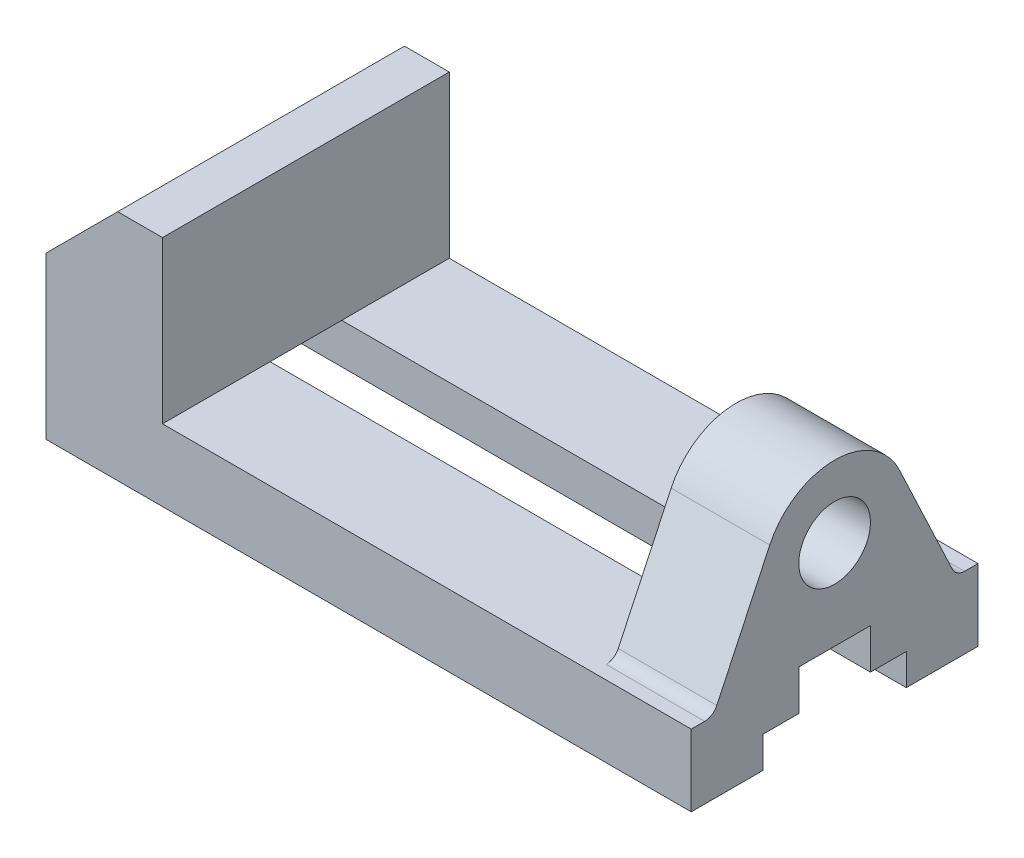
ISO-10303-21;
HEADER;
FILE_DESCRIPTION(('STEP AP214'),'2;1');
FILE_NAME('part.step','',(''),(''),'','','');
FILE_SCHEMA(('AUTOMOTIVE_DESIGN { 1 0 10303 214 1 1 1 1 }'));
ENDSEC;
DATA;
#1=APPLICATION_CONTEXT('core data for automotive mechanical design processes');
#2=APPLICATION_PROTOCOL_DEFINITION('international standard','automotive_design',2000,#1);
#3=PRODUCT_CONTEXT('',#1,'mechanical');
#4=PRODUCT('Part','Part','',(#3));
#5=PRODUCT_RELATED_PRODUCT_CATEGORY('part','',(#4));
#6=PRODUCT_DEFINITION_FORMATION('','',#4);
#7=PRODUCT_DEFINITION_CONTEXT('part definition',#1,'design');
#8=PRODUCT_DEFINITION('design','',#6,#7);
#9=PRODUCT_DEFINITION_SHAPE('','',#8);
#10=(LENGTH_UNIT() NAMED_UNIT(*) SI_UNIT(.MILLI.,.METRE.));
#11=(NAMED_UNIT(*) PLANE_ANGLE_UNIT() SI_UNIT($,.RADIAN.));
#12=(NAMED_UNIT(*) SI_UNIT($,.STERADIAN.) SOLID_ANGLE_UNIT());
#13=UNCERTAINTY_MEASURE_WITH_UNIT(LENGTH_MEASURE(1.E-05),#10,'distance_accuracy_value','');
#14=(GEOMETRIC_REPRESENTATION_CONTEXT(3) GLOBAL_UNCERTAINTY_ASSIGNED_CONTEXT((#13)) GLOBAL_UNIT_ASSIGNED_CONTEXT((#10,
#11,#12)) REPRESENTATION_CONTEXT('',''));
#15=CARTESIAN_POINT('',(0.,0.,0.));
#16=DIRECTION('',(0.,0.,1.));
#17=DIRECTION('',(1.,0.,0.));
#18=AXIS2_PLACEMENT_3D('',#15,#16,#17);
#19=CARTESIAN_POINT('',(-46.,8.,32.));
#20=DIRECTION('',(0.,-1.,0.));
#21=DIRECTION('',(0.,0.,-1.));
#22=AXIS2_PLACEMENT_3D('',#19,#20,#21);
#23=PLANE('',#22);
#24=DIRECTION('',(0.,0.,-1.));
#25=VECTOR('',#24,1.);
#26=CARTESIAN_POINT('',(72.,8.,32.));
#27=LINE('',#26,#25);
#28=CARTESIAN_POINT('',(72.,8.,32.));
#29=VERTEX_POINT('',#28);
#30=CARTESIAN_POINT('',(72.,8.,29.));
#31=VERTEX_POINT('',#30);
#32=EDGE_CURVE('E11',#29,#31,#27,.T.);
#33=ORIENTED_EDGE('',*,*,#32,.T.);
#34=DIRECTION('',(1.,0.,0.));
#35=VECTOR('',#34,1.);
#36=CARTESIAN_POINT('',(50.,8.,29.));
#37=LINE('',#36,#35);
#38=CARTESIAN_POINT('',(50.,8.,29.));
#39=VERTEX_POINT('',#38);
#40=EDGE_CURVE('E248',#39,#31,#37,.T.);
#41=ORIENTED_EDGE('',*,*,#40,.F.);
#42=DIRECTION('',(0.,0.,-1.));
#43=VECTOR('',#42,1.);
#44=CARTESIAN_POINT('',(50.,8.,0.));
#45=LINE('',#44,#43);
#46=CARTESIAN_POINT('',(50.,8.,8.));
#47=VERTEX_POINT('',#46);
#48=EDGE_CURVE('E223',#39,#47,#45,.T.);
#49=ORIENTED_EDGE('',*,*,#48,.T.);
#50=DIRECTION('',(1.,0.,0.));
#51=VECTOR('',#50,1.);
#52=CARTESIAN_POINT('',(-72.001,8.,8.));
#53=LINE('',#52,#51);
#54=CARTESIAN_POINT('',(-46.,8.,8.));
#55=VERTEX_POINT('',#54);
#56=EDGE_CURVE('E301',#55,#47,#53,.T.);
#57=ORIENTED_EDGE('',*,*,#56,.F.);
#58=DIRECTION('',(0.,0.,-1.));
#59=VECTOR('',#58,1.);
#60=CARTESIAN_POINT('',(-46.,8.,32.));
#61=LINE('',#60,#59);
#62=CARTESIAN_POINT('',(-46.,8.,32.));
#63=VERTEX_POINT('',#62);
#64=EDGE_CURVE('E367',#63,#55,#61,.T.);
#65=ORIENTED_EDGE('',*,*,#64,.F.);
#66=DIRECTION('',(-1.,0.,0.));
#67=VECTOR('',#66,1.);
#68=CARTESIAN_POINT('',(-46.,8.,32.));
#69=LINE('',#68,#67);
#70=EDGE_CURVE('E320',#29,#63,#69,.T.);
#71=ORIENTED_EDGE('',*,*,#70,.F.);
#72=EDGE_LOOP('',(#33,#41,#49,#57,#65,#71));
#73=FACE_BOUND('',#72,.T.);
#74=ADVANCED_FACE('F32',(#73),#23,.F.);
#75=CARTESIAN_POINT('',(-72.,-8.,32.));
#76=DIRECTION('',(0.,1.,0.));
#77=DIRECTION('',(0.,0.,1.));
#78=AXIS2_PLACEMENT_3D('',#75,#76,#77);
#79=PLANE('',#78);
#80=DIRECTION('',(0.,0.,-1.));
#81=VECTOR('',#80,1.);
#82=CARTESIAN_POINT('',(-72.,-8.,32.));
#83=LINE('',#82,#81);
#84=CARTESIAN_POINT('',(-72.,-8.,32.));
#85=VERTEX_POINT('',#84);
#86=CARTESIAN_POINT('',(-72.,-8.,16.));
#87=VERTEX_POINT('',#86);
#88=EDGE_CURVE('E355',#85,#87,#83,.T.);
#89=ORIENTED_EDGE('',*,*,#88,.T.);
#90=DIRECTION('',(1.,0.,0.));
#91=VECTOR('',#90,1.);
#92=CARTESIAN_POINT('',(-72.001,-8.,16.));
#93=LINE('',#92,#91);
#94=CARTESIAN_POINT('',(72.,-8.,16.));
#95=VERTEX_POINT('',#94);
#96=EDGE_CURVE('E290',#87,#95,#93,.T.);
#97=ORIENTED_EDGE('',*,*,#96,.T.);
#98=DIRECTION('',(0.,0.,-1.));
#99=VECTOR('',#98,1.);
#100=CARTESIAN_POINT('',(72.,-8.,32.));
#101=LINE('',#100,#99);
#102=CARTESIAN_POINT('',(72.,-8.,32.));
#103=VERTEX_POINT('',#102);
#104=EDGE_CURVE('E351',#103,#95,#101,.T.);
#105=ORIENTED_EDGE('',*,*,#104,.F.);
#106=DIRECTION('',(1.,0.,0.));
#107=VECTOR('',#106,1.);
#108=CARTESIAN_POINT('',(-72.,-8.,32.));
#109=LINE('',#108,#107);
#110=EDGE_CURVE('E331',#85,#103,#109,.T.);
#111=ORIENTED_EDGE('',*,*,#110,.F.);
#112=EDGE_LOOP('',(#89,#97,#105,#111));
#113=FACE_BOUND('',#112,.T.);
#114=ADVANCED_FACE('F459',(#113),#79,.F.);
#115=CARTESIAN_POINT('',(72.,8.,32.));
#116=DIRECTION('',(-1.,0.,0.));
#117=DIRECTION('',(0.,0.,1.));
#118=AXIS2_PLACEMENT_3D('',#115,#116,#117);
#119=PLANE('',#118);
#120=CARTESIAN_POINT('',(72.,8.,-29.));
#121=VERTEX_POINT('',#120);
#122=CARTESIAN_POINT('',(72.,8.,-32.));
#123=VERTEX_POINT('',#122);
#124=EDGE_CURVE('E40',#121,#123,#27,.T.);
#125=ORIENTED_EDGE('',*,*,#124,.F.);
#126=CARTESIAN_POINT('',(72.,11.,-29.));
#127=DIRECTION('',(1.,0.,0.));
#128=DIRECTION('',(0.,0.,-1.));
#129=AXIS2_PLACEMENT_3D('',#126,#127,#128);
#130=CIRCLE('',#129,3.);
#131=CARTESIAN_POINT('',(72.,9.72249213756461,-26.285598839262));
#132=VERTEX_POINT('',#131);
#133=EDGE_CURVE('E216',#132,#121,#130,.T.);
#134=ORIENTED_EDGE('',*,*,#133,.F.);
#135=DIRECTION('',(0.,0.904800386912664,0.425835954145132));
#136=VECTOR('',#135,1.);
#137=CARTESIAN_POINT('',(72.,11.8907905419176,-25.2651092006141));
#138=LINE('',#137,#136);
#139=CARTESIAN_POINT('',(72.,34.8133752663221,-14.4768061906026));
#140=VERTEX_POINT('',#139);
#141=EDGE_CURVE('E231',#132,#140,#138,.T.);
#142=ORIENTED_EDGE('',*,*,#141,.T.);
#143=CARTESIAN_POINT('',(72.,28.,0.));
#144=DIRECTION('',(1.,0.,0.));
#145=DIRECTION('',(0.,0.,-1.));
#146=AXIS2_PLACEMENT_3D('',#143,#144,#145);
#147=CIRCLE('',#146,16.);
#148=CARTESIAN_POINT('',(72.,34.8133752663221,14.4768061906026));
#149=VERTEX_POINT('',#148);
#150=EDGE_CURVE('E192',#140,#149,#147,.T.);
#151=ORIENTED_EDGE('',*,*,#150,.T.);
#152=DIRECTION('',(0.,0.904800386912664,-0.425835954145132));
#153=VECTOR('',#152,1.);
#154=CARTESIAN_POINT('',(72.,11.8907905419176,25.2651092006141));
#155=LINE('',#154,#153);
#156=CARTESIAN_POINT('',(72.,9.72249213756461,26.285598839262));
#157=VERTEX_POINT('',#156);
#158=EDGE_CURVE('E234',#157,#149,#155,.T.);
#159=ORIENTED_EDGE('',*,*,#158,.F.);
#160=CARTESIAN_POINT('',(72.,11.,29.));
#161=DIRECTION('',(1.,0.,0.));
#162=DIRECTION('',(0.,0.,-1.));
#163=AXIS2_PLACEMENT_3D('',#160,#161,#162);
#164=CIRCLE('',#163,3.);
#165=EDGE_CURVE('E237',#157,#31,#164,.F.);
#166=ORIENTED_EDGE('',*,*,#165,.T.);
#167=ORIENTED_EDGE('',*,*,#32,.F.);
#168=DIRECTION('',(0.,1.,0.));
#169=VECTOR('',#168,1.);
#170=CARTESIAN_POINT('',(72.,8.,32.));
#171=LINE('',#170,#169);
#172=EDGE_CURVE('E317',#103,#29,#171,.T.);
#173=ORIENTED_EDGE('',*,*,#172,.F.);
#174=ORIENTED_EDGE('',*,*,#104,.T.);
#175=DIRECTION('',(0.,-1.,0.));
#176=VECTOR('',#175,1.);
#177=CARTESIAN_POINT('',(72.,-8.,16.));
#178=LINE('',#177,#176);
#179=CARTESIAN_POINT('',(72.,-0.999999999999998,16.));
#180=VERTEX_POINT('',#179);
#181=EDGE_CURVE('E287',#180,#95,#178,.T.);
#182=ORIENTED_EDGE('',*,*,#181,.F.);
#183=DIRECTION('',(0.,0.,1.));
#184=VECTOR('',#183,1.);
#185=CARTESIAN_POINT('',(72.,-0.999999999999998,16.));
#186=LINE('',#185,#184);
#187=CARTESIAN_POINT('',(72.,-0.999999999999999,8.));
#188=VERTEX_POINT('',#187);
#189=EDGE_CURVE('E284',#188,#180,#186,.T.);
#190=ORIENTED_EDGE('',*,*,#189,.F.);
#191=DIRECTION('',(0.,-1.,0.));
#192=VECTOR('',#191,1.);
#193=CARTESIAN_POINT('',(72.,-0.999999999999999,8.));
#194=LINE('',#193,#192);
#195=CARTESIAN_POINT('',(72.,8.,8.));
#196=VERTEX_POINT('',#195);
#197=EDGE_CURVE('E281',#196,#188,#194,.T.);
#198=ORIENTED_EDGE('',*,*,#197,.F.);
#199=DIRECTION('',(0.,0.,-1.));
#200=VECTOR('',#199,1.);
#201=CARTESIAN_POINT('',(72.,8.,0.));
#202=LINE('',#201,#200);
#203=CARTESIAN_POINT('',(72.,8.,-8.));
#204=VERTEX_POINT('',#203);
#205=EDGE_CURVE('E240',#196,#204,#202,.T.);
#206=ORIENTED_EDGE('',*,*,#205,.T.);
#207=DIRECTION('',(0.,1.,0.));
#208=VECTOR('',#207,1.);
#209=CARTESIAN_POINT('',(72.,-0.999999999999994,-8.));
#210=LINE('',#209,#208);
#211=CARTESIAN_POINT('',(72.,-0.999999999999994,-8.));
#212=VERTEX_POINT('',#211);
#213=EDGE_CURVE('E279',#212,#204,#210,.T.);
#214=ORIENTED_EDGE('',*,*,#213,.F.);
#215=DIRECTION('',(0.,0.,1.));
#216=VECTOR('',#215,1.);
#217=CARTESIAN_POINT('',(72.,-0.999999999999995,-16.));
#218=LINE('',#217,#216);
#219=CARTESIAN_POINT('',(72.,-0.999999999999995,-16.));
#220=VERTEX_POINT('',#219);
#221=EDGE_CURVE('E276',#220,#212,#218,.T.);
#222=ORIENTED_EDGE('',*,*,#221,.F.);
#223=DIRECTION('',(0.,1.,0.));
#224=VECTOR('',#223,1.);
#225=CARTESIAN_POINT('',(72.,-7.99999999999999,-16.));
#226=LINE('',#225,#224);
#227=CARTESIAN_POINT('',(72.,-7.99999999999999,-16.));
#228=VERTEX_POINT('',#227);
#229=EDGE_CURVE('E273',#228,#220,#226,.T.);
#230=ORIENTED_EDGE('',*,*,#229,.F.);
#231=CARTESIAN_POINT('',(72.,-8.,-32.));
#232=VERTEX_POINT('',#231);
#233=EDGE_CURVE('E333',#228,#232,#101,.T.);
#234=ORIENTED_EDGE('',*,*,#233,.T.);
#235=DIRECTION('',(0.,1.,0.));
#236=VECTOR('',#235,1.);
#237=CARTESIAN_POINT('',(72.,8.,-32.));
#238=LINE('',#237,#236);
#239=EDGE_CURVE('E316',#232,#123,#238,.T.);
#240=ORIENTED_EDGE('',*,*,#239,.T.);
#241=EDGE_LOOP('',(#125,#134,#142,#151,#159,#166,#167,#173,#174,#182,#190,#198,#206,#214,#222,
#230,#234,#240));
#242=FACE_BOUND('',#241,.T.);
#243=CARTESIAN_POINT('',(72.,28.,0.));
#244=DIRECTION('',(1.,0.,0.));
#245=DIRECTION('',(0.,0.,-1.));
#246=AXIS2_PLACEMENT_3D('',#243,#244,#245);
#247=CIRCLE('',#246,8.);
#248=CARTESIAN_POINT('',(72.,28.,-8.));
#249=VERTEX_POINT('',#248);
#250=EDGE_CURVE('E213',#249,#249,#247,.T.);
#251=ORIENTED_EDGE('',*,*,#250,.F.);
#252=EDGE_LOOP('',(#251));
#253=FACE_BOUND('',#252,.T.);
#254=ADVANCED_FACE('F34',(#242,#253),#119,.F.);
#255=CARTESIAN_POINT('',(50.,8.,-8.));
#256=VERTEX_POINT('',#255);
#257=CARTESIAN_POINT('',(50.,8.,-29.));
#258=VERTEX_POINT('',#257);
#259=EDGE_CURVE('E47',#256,#258,#45,.T.);
#260=ORIENTED_EDGE('',*,*,#259,.T.);
#261=DIRECTION('',(1.,0.,0.));
#262=VECTOR('',#261,1.);
#263=CARTESIAN_POINT('',(50.,8.,-29.));
#264=LINE('',#263,#262);
#265=EDGE_CURVE('E52',#258,#121,#264,.T.);
#266=ORIENTED_EDGE('',*,*,#265,.T.);
#267=ORIENTED_EDGE('',*,*,#124,.T.);
#268=DIRECTION('',(-1.,0.,0.));
#269=VECTOR('',#268,1.);
#270=CARTESIAN_POINT('',(-46.,8.,-32.));
#271=LINE('',#270,#269);
#272=CARTESIAN_POINT('',(-46.,8.,-32.));
#273=VERTEX_POINT('',#272);
#274=EDGE_CURVE('E336',#123,#273,#271,.T.);
#275=ORIENTED_EDGE('',*,*,#274,.T.);
#276=CARTESIAN_POINT('',(-46.,8.,-8.));
#277=VERTEX_POINT('',#276);
#278=EDGE_CURVE('E366',#277,#273,#61,.T.);
#279=ORIENTED_EDGE('',*,*,#278,.F.);
#280=DIRECTION('',(1.,0.,0.));
#281=VECTOR('',#280,1.);
#282=CARTESIAN_POINT('',(-72.001,8.,-8.));
#283=LINE('',#282,#281);
#284=EDGE_CURVE('E305',#277,#256,#283,.T.);
#285=ORIENTED_EDGE('',*,*,#284,.T.);
#286=EDGE_LOOP('',(#260,#266,#267,#275,#279,#285));
#287=FACE_BOUND('',#286,.T.);
#288=ADVANCED_FACE('F377',(#287),#23,.F.);
#289=CARTESIAN_POINT('',(-46.,44.,32.));
#290=DIRECTION('',(-1.,0.,0.));
#291=DIRECTION('',(0.,0.,1.));
#292=AXIS2_PLACEMENT_3D('',#289,#290,#291);
#293=PLANE('',#292);
#294=DIRECTION('',(0.,1.,0.));
#295=VECTOR('',#294,1.);
#296=CARTESIAN_POINT('',(-46.,44.,-32.));
#297=LINE('',#296,#295);
#298=CARTESIAN_POINT('',(-46.,44.,-32.));
#299=VERTEX_POINT('',#298);
#300=EDGE_CURVE('E339',#273,#299,#297,.T.);
#301=ORIENTED_EDGE('',*,*,#300,.T.);
#302=DIRECTION('',(0.,0.,-1.));
#303=VECTOR('',#302,1.);
#304=CARTESIAN_POINT('',(-46.,44.,32.));
#305=LINE('',#304,#303);
#306=CARTESIAN_POINT('',(-46.,44.,32.));
#307=VERTEX_POINT('',#306);
#308=EDGE_CURVE('E364',#307,#299,#305,.T.);
#309=ORIENTED_EDGE('',*,*,#308,.F.);
#310=DIRECTION('',(0.,1.,0.));
#311=VECTOR('',#310,1.);
#312=CARTESIAN_POINT('',(-46.,44.,32.));
#313=LINE('',#312,#311);
#314=EDGE_CURVE('E323',#63,#307,#313,.T.);
#315=ORIENTED_EDGE('',*,*,#314,.F.);
#316=ORIENTED_EDGE('',*,*,#64,.T.);
#317=DIRECTION('',(0.,0.,-1.));
#318=VECTOR('',#317,1.);
#319=CARTESIAN_POINT('',(-46.,8.,32.));
#320=LINE('',#319,#318);
#321=EDGE_CURVE('E313',#55,#277,#320,.T.);
#322=ORIENTED_EDGE('',*,*,#321,.T.);
#323=ORIENTED_EDGE('',*,*,#278,.T.);
#324=EDGE_LOOP('',(#301,#309,#315,#316,#322,#323));
#325=FACE_BOUND('',#324,.T.);
#326=ADVANCED_FACE('F373',(#325),#293,.F.);
#327=CARTESIAN_POINT('',(-46.,44.,32.));
#328=DIRECTION('',(0.,-1.,0.));
#329=DIRECTION('',(0.,0.,-1.));
#330=AXIS2_PLACEMENT_3D('',#327,#328,#329);
#331=PLANE('',#330);
#332=DIRECTION('',(-1.,0.,0.));
#333=VECTOR('',#332,1.);
#334=CARTESIAN_POINT('',(-46.,44.,-32.));
#335=LINE('',#334,#333);
#336=CARTESIAN_POINT('',(-56.,44.,-32.));
#337=VERTEX_POINT('',#336);
#338=EDGE_CURVE('E341',#299,#337,#335,.T.);
#339=ORIENTED_EDGE('',*,*,#338,.T.);
#340=DIRECTION('',(0.,0.,-1.));
#341=VECTOR('',#340,1.);
#342=CARTESIAN_POINT('',(-56.,44.,32.));
#343=LINE('',#342,#341);
#344=CARTESIAN_POINT('',(-56.,44.,32.));
#345=VERTEX_POINT('',#344);
#346=EDGE_CURVE('E361',#345,#337,#343,.T.);
#347=ORIENTED_EDGE('',*,*,#346,.F.);
#348=DIRECTION('',(-1.,0.,0.));
#349=VECTOR('',#348,1.);
#350=CARTESIAN_POINT('',(-46.,44.,32.));
#351=LINE('',#350,#349);
#352=EDGE_CURVE('E325',#307,#345,#351,.T.);
#353=ORIENTED_EDGE('',*,*,#352,.F.);
#354=ORIENTED_EDGE('',*,*,#308,.T.);
#355=EDGE_LOOP('',(#339,#347,#353,#354));
#356=FACE_BOUND('',#355,.T.);
#357=ADVANCED_FACE('F385',(#356),#331,.F.);
#358=CARTESIAN_POINT('',(-56.,44.,32.));
#359=DIRECTION('',(0.707106781186548,-0.707106781186547,0.));
#360=DIRECTION('',(0.707106781186547,0.707106781186548,0.));
#361=AXIS2_PLACEMENT_3D('',#358,#359,#360);
#362=PLANE('',#361);
#363=DIRECTION('',(-0.707106781186547,-0.707106781186548,0.));
#364=VECTOR('',#363,1.);
#365=CARTESIAN_POINT('',(-56.,44.,-32.));
#366=LINE('',#365,#364);
#367=CARTESIAN_POINT('',(-72.,28.,-32.));
#368=VERTEX_POINT('',#367);
#369=EDGE_CURVE('E343',#337,#368,#366,.T.);
#370=ORIENTED_EDGE('',*,*,#369,.T.);
#371=DIRECTION('',(0.,0.,-1.));
#372=VECTOR('',#371,1.);
#373=CARTESIAN_POINT('',(-72.,28.,32.));
#374=LINE('',#373,#372);
#375=CARTESIAN_POINT('',(-72.,28.,32.));
#376=VERTEX_POINT('',#375);
#377=EDGE_CURVE('E358',#376,#368,#374,.T.);
#378=ORIENTED_EDGE('',*,*,#377,.F.);
#379=DIRECTION('',(-0.707106781186547,-0.707106781186548,0.));
#380=VECTOR('',#379,1.);
#381=CARTESIAN_POINT('',(-56.,44.,32.));
#382=LINE('',#381,#380);
#383=EDGE_CURVE('E327',#345,#376,#382,.T.);
#384=ORIENTED_EDGE('',*,*,#383,.F.);
#385=ORIENTED_EDGE('',*,*,#346,.T.);
#386=EDGE_LOOP('',(#370,#378,#384,#385));
#387=FACE_BOUND('',#386,.T.);
#388=ADVANCED_FACE('F389',(#387),#362,.F.);
#389=CARTESIAN_POINT('',(-72.,8.,32.));
#390=DIRECTION('',(1.,0.,0.));
#391=DIRECTION('',(0.,0.,-1.));
#392=AXIS2_PLACEMENT_3D('',#389,#390,#391);
#393=PLANE('',#392);
#394=DIRECTION('',(0.,0.,-1.));
#395=VECTOR('',#394,1.);
#396=CARTESIAN_POINT('',(-72.,-0.999999999999998,16.));
#397=LINE('',#396,#395);
#398=CARTESIAN_POINT('',(-72.,-0.999999999999998,16.));
#399=VERTEX_POINT('',#398);
#400=CARTESIAN_POINT('',(-72.,-0.999999999999999,8.));
#401=VERTEX_POINT('',#400);
#402=EDGE_CURVE('E267',#399,#401,#397,.T.);
#403=ORIENTED_EDGE('',*,*,#402,.F.);
#404=DIRECTION('',(0.,1.,0.));
#405=VECTOR('',#404,1.);
#406=CARTESIAN_POINT('',(-72.,-8.,16.));
#407=LINE('',#406,#405);
#408=EDGE_CURVE('E270',#87,#399,#407,.T.);
#409=ORIENTED_EDGE('',*,*,#408,.F.);
#410=ORIENTED_EDGE('',*,*,#88,.F.);
#411=DIRECTION('',(0.,-1.,0.));
#412=VECTOR('',#411,1.);
#413=CARTESIAN_POINT('',(-72.,8.,32.));
#414=LINE('',#413,#412);
#415=EDGE_CURVE('E329',#376,#85,#414,.T.);
#416=ORIENTED_EDGE('',*,*,#415,.F.);
#417=ORIENTED_EDGE('',*,*,#377,.T.);
#418=DIRECTION('',(0.,-1.,0.));
#419=VECTOR('',#418,1.);
#420=CARTESIAN_POINT('',(-72.,8.,-32.));
#421=LINE('',#420,#419);
#422=CARTESIAN_POINT('',(-72.,-8.,-32.));
#423=VERTEX_POINT('',#422);
#424=EDGE_CURVE('E346',#368,#423,#421,.T.);
#425=ORIENTED_EDGE('',*,*,#424,.T.);
#426=CARTESIAN_POINT('',(-72.,-8.,-16.));
#427=VERTEX_POINT('',#426);
#428=EDGE_CURVE('E354',#427,#423,#83,.T.);
#429=ORIENTED_EDGE('',*,*,#428,.F.);
#430=DIRECTION('',(0.,-1.,0.));
#431=VECTOR('',#430,1.);
#432=CARTESIAN_POINT('',(-72.,-7.99999999999999,-16.));
#433=LINE('',#432,#431);
#434=CARTESIAN_POINT('',(-72.,-0.999999999999995,-16.));
#435=VERTEX_POINT('',#434);
#436=EDGE_CURVE('E293',#435,#427,#433,.T.);
#437=ORIENTED_EDGE('',*,*,#436,.F.);
#438=DIRECTION('',(0.,0.,-1.));
#439=VECTOR('',#438,1.);
#440=CARTESIAN_POINT('',(-72.,-0.999999999999995,-16.));
#441=LINE('',#440,#439);
#442=CARTESIAN_POINT('',(-72.,-0.999999999999994,-8.));
#443=VERTEX_POINT('',#442);
#444=EDGE_CURVE('E255',#443,#435,#441,.T.);
#445=ORIENTED_EDGE('',*,*,#444,.F.);
#446=DIRECTION('',(0.,-1.,0.));
#447=VECTOR('',#446,1.);
#448=CARTESIAN_POINT('',(-72.,-0.999999999999994,-8.));
#449=LINE('',#448,#447);
#450=CARTESIAN_POINT('',(-72.,8.,-8.));
#451=VERTEX_POINT('',#450);
#452=EDGE_CURVE('E258',#451,#443,#449,.T.);
#453=ORIENTED_EDGE('',*,*,#452,.F.);
#454=DIRECTION('',(0.,0.,-1.));
#455=VECTOR('',#454,1.);
#456=CARTESIAN_POINT('',(-72.,8.,8.));
#457=LINE('',#456,#455);
#458=CARTESIAN_POINT('',(-72.,8.,8.));
#459=VERTEX_POINT('',#458);
#460=EDGE_CURVE('E261',#459,#451,#457,.T.);
#461=ORIENTED_EDGE('',*,*,#460,.F.);
#462=DIRECTION('',(0.,1.,0.));
#463=VECTOR('',#462,1.);
#464=CARTESIAN_POINT('',(-72.,-0.999999999999999,8.));
#465=LINE('',#464,#463);
#466=EDGE_CURVE('E264',#401,#459,#465,.T.);
#467=ORIENTED_EDGE('',*,*,#466,.F.);
#468=EDGE_LOOP('',(#403,#409,#410,#416,#417,#425,#429,#437,#445,#453,#461,#467));
#469=FACE_BOUND('',#468,.T.);
#470=ADVANCED_FACE('F428',(#469),#393,.F.);
#471=ORIENTED_EDGE('',*,*,#233,.F.);
#472=DIRECTION('',(1.,0.,0.));
#473=VECTOR('',#472,1.);
#474=CARTESIAN_POINT('',(-72.001,-7.99999999999999,-16.));
#475=LINE('',#474,#473);
#476=EDGE_CURVE('E289',#427,#228,#475,.T.);
#477=ORIENTED_EDGE('',*,*,#476,.F.);
#478=ORIENTED_EDGE('',*,*,#428,.T.);
#479=DIRECTION('',(1.,0.,0.));
#480=VECTOR('',#479,1.);
#481=CARTESIAN_POINT('',(-72.,-8.,-32.));
#482=LINE('',#481,#480);
#483=EDGE_CURVE('E321',#423,#232,#482,.T.);
#484=ORIENTED_EDGE('',*,*,#483,.T.);
#485=EDGE_LOOP('',(#471,#477,#478,#484));
#486=FACE_BOUND('',#485,.T.);
#487=ADVANCED_FACE('F438',(#486),#79,.F.);
#488=CARTESIAN_POINT('',(0.,0.,32.));
#489=DIRECTION('',(0.,0.,1.));
#490=DIRECTION('',(1.,0.,0.));
#491=AXIS2_PLACEMENT_3D('',#488,#489,#490);
#492=PLANE('',#491);
#493=ORIENTED_EDGE('',*,*,#172,.T.);
#494=ORIENTED_EDGE('',*,*,#70,.T.);
#495=ORIENTED_EDGE('',*,*,#314,.T.);
#496=ORIENTED_EDGE('',*,*,#352,.T.);
#497=ORIENTED_EDGE('',*,*,#383,.T.);
#498=ORIENTED_EDGE('',*,*,#415,.T.);
#499=ORIENTED_EDGE('',*,*,#110,.T.);
#500=EDGE_LOOP('',(#493,#494,#495,#496,#497,#498,#499));
#501=FACE_BOUND('',#500,.T.);
#502=ADVANCED_FACE('F393',(#501),#492,.T.);
#503=CARTESIAN_POINT('',(0.,0.,-32.));
#504=DIRECTION('',(0.,0.,1.));
#505=DIRECTION('',(1.,0.,0.));
#506=AXIS2_PLACEMENT_3D('',#503,#504,#505);
#507=PLANE('',#506);
#508=ORIENTED_EDGE('',*,*,#239,.F.);
#509=ORIENTED_EDGE('',*,*,#483,.F.);
#510=ORIENTED_EDGE('',*,*,#424,.F.);
#511=ORIENTED_EDGE('',*,*,#369,.F.);
#512=ORIENTED_EDGE('',*,*,#338,.F.);
#513=ORIENTED_EDGE('',*,*,#300,.F.);
#514=ORIENTED_EDGE('',*,*,#274,.F.);
#515=EDGE_LOOP('',(#508,#509,#510,#511,#512,#513,#514));
#516=FACE_BOUND('',#515,.T.);
#517=ADVANCED_FACE('F381',(#516),#507,.F.);
#518=CARTESIAN_POINT('',(-72.001,8.,8.));
#519=DIRECTION('',(0.,1.,0.));
#520=DIRECTION('',(0.,0.,1.));
#521=AXIS2_PLACEMENT_3D('',#518,#519,#520);
#522=PLANE('',#521);
#523=EDGE_CURVE('E298',#459,#55,#53,.T.);
#524=ORIENTED_EDGE('',*,*,#523,.F.);
#525=ORIENTED_EDGE('',*,*,#460,.T.);
#526=EDGE_CURVE('E302',#451,#277,#283,.T.);
#527=ORIENTED_EDGE('',*,*,#526,.T.);
#528=ORIENTED_EDGE('',*,*,#321,.F.);
#529=EDGE_LOOP('',(#524,#525,#527,#528));
#530=FACE_BOUND('',#529,.T.);
#531=ADVANCED_FACE('F407',(#530),#522,.F.);
#532=CARTESIAN_POINT('',(-72.001,-8.,16.));
#533=DIRECTION('',(0.,0.,1.));
#534=DIRECTION('',(1.,0.,0.));
#535=AXIS2_PLACEMENT_3D('',#532,#533,#534);
#536=PLANE('',#535);
#537=ORIENTED_EDGE('',*,*,#408,.T.);
#538=DIRECTION('',(1.,0.,0.));
#539=VECTOR('',#538,1.);
#540=CARTESIAN_POINT('',(-72.001,-0.999999999999998,16.));
#541=LINE('',#540,#539);
#542=EDGE_CURVE('E294',#399,#180,#541,.T.);
#543=ORIENTED_EDGE('',*,*,#542,.T.);
#544=ORIENTED_EDGE('',*,*,#181,.T.);
#545=ORIENTED_EDGE('',*,*,#96,.F.);
#546=EDGE_LOOP('',(#537,#543,#544,#545));
#547=FACE_BOUND('',#546,.T.);
#548=ADVANCED_FACE('F520',(#547),#536,.F.);
#549=CARTESIAN_POINT('',(-72.001,-0.999999999999998,16.));
#550=DIRECTION('',(0.,1.,0.));
#551=DIRECTION('',(0.,0.,1.));
#552=AXIS2_PLACEMENT_3D('',#549,#550,#551);
#553=PLANE('',#552);
#554=ORIENTED_EDGE('',*,*,#402,.T.);
#555=DIRECTION('',(1.,0.,0.));
#556=VECTOR('',#555,1.);
#557=CARTESIAN_POINT('',(-72.001,-0.999999999999999,8.));
#558=LINE('',#557,#556);
#559=EDGE_CURVE('E296',#401,#188,#558,.T.);
#560=ORIENTED_EDGE('',*,*,#559,.T.);
#561=ORIENTED_EDGE('',*,*,#189,.T.);
#562=ORIENTED_EDGE('',*,*,#542,.F.);
#563=EDGE_LOOP('',(#554,#560,#561,#562));
#564=FACE_BOUND('',#563,.T.);
#565=ADVANCED_FACE('F425',(#564),#553,.F.);
#566=CARTESIAN_POINT('',(-72.001,-0.999999999999999,8.));
#567=DIRECTION('',(0.,0.,1.));
#568=DIRECTION('',(1.,0.,0.));
#569=AXIS2_PLACEMENT_3D('',#566,#567,#568);
#570=PLANE('',#569);
#571=ORIENTED_EDGE('',*,*,#466,.T.);
#572=ORIENTED_EDGE('',*,*,#523,.T.);
#573=ORIENTED_EDGE('',*,*,#56,.T.);
#574=DIRECTION('',(1.,0.,0.));
#575=VECTOR('',#574,1.);
#576=CARTESIAN_POINT('',(-72.001,8.,8.));
#577=LINE('',#576,#575);
#578=EDGE_CURVE('E246',#47,#196,#577,.T.);
#579=ORIENTED_EDGE('',*,*,#578,.T.);
#580=ORIENTED_EDGE('',*,*,#197,.T.);
#581=ORIENTED_EDGE('',*,*,#559,.F.);
#582=EDGE_LOOP('',(#571,#572,#573,#579,#580,#581));
#583=FACE_BOUND('',#582,.T.);
#584=ADVANCED_FACE('F402',(#583),#570,.F.);
#585=CARTESIAN_POINT('',(-72.001,-0.999999999999994,-8.));
#586=DIRECTION('',(0.,0.,-1.));
#587=DIRECTION('',(-1.,0.,0.));
#588=AXIS2_PLACEMENT_3D('',#585,#586,#587);
#589=PLANE('',#588);
#590=ORIENTED_EDGE('',*,*,#452,.T.);
#591=DIRECTION('',(1.,0.,0.));
#592=VECTOR('',#591,1.);
#593=CARTESIAN_POINT('',(-72.001,-0.999999999999994,-8.));
#594=LINE('',#593,#592);
#595=EDGE_CURVE('E307',#443,#212,#594,.T.);
#596=ORIENTED_EDGE('',*,*,#595,.T.);
#597=ORIENTED_EDGE('',*,*,#213,.T.);
#598=EDGE_CURVE('E306',#256,#204,#283,.T.);
#599=ORIENTED_EDGE('',*,*,#598,.F.);
#600=ORIENTED_EDGE('',*,*,#284,.F.);
#601=ORIENTED_EDGE('',*,*,#526,.F.);
#602=EDGE_LOOP('',(#590,#596,#597,#599,#600,#601));
#603=FACE_BOUND('',#602,.T.);
#604=ADVANCED_FACE('F410',(#603),#589,.F.);
#605=CARTESIAN_POINT('',(-72.001,-0.999999999999995,-16.));
#606=DIRECTION('',(0.,1.,0.));
#607=DIRECTION('',(0.,0.,1.));
#608=AXIS2_PLACEMENT_3D('',#605,#606,#607);
#609=PLANE('',#608);
#610=ORIENTED_EDGE('',*,*,#444,.T.);
#611=DIRECTION('',(1.,0.,0.));
#612=VECTOR('',#611,1.);
#613=CARTESIAN_POINT('',(-72.001,-0.999999999999995,-16.));
#614=LINE('',#613,#612);
#615=EDGE_CURVE('E309',#435,#220,#614,.T.);
#616=ORIENTED_EDGE('',*,*,#615,.T.);
#617=ORIENTED_EDGE('',*,*,#221,.T.);
#618=ORIENTED_EDGE('',*,*,#595,.F.);
#619=EDGE_LOOP('',(#610,#616,#617,#618));
#620=FACE_BOUND('',#619,.T.);
#621=ADVANCED_FACE('F432',(#620),#609,.F.);
#622=CARTESIAN_POINT('',(-72.001,-7.99999999999999,-16.));
#623=DIRECTION('',(0.,0.,-1.));
#624=DIRECTION('',(-1.,0.,0.));
#625=AXIS2_PLACEMENT_3D('',#622,#623,#624);
#626=PLANE('',#625);
#627=ORIENTED_EDGE('',*,*,#436,.T.);
#628=ORIENTED_EDGE('',*,*,#476,.T.);
#629=ORIENTED_EDGE('',*,*,#229,.T.);
#630=ORIENTED_EDGE('',*,*,#615,.F.);
#631=EDGE_LOOP('',(#627,#628,#629,#630));
#632=FACE_BOUND('',#631,.T.);
#633=ADVANCED_FACE('F548',(#632),#626,.F.);
#634=CARTESIAN_POINT('',(50.,8.,0.));
#635=DIRECTION('',(0.,-1.,0.));
#636=DIRECTION('',(0.,0.,-1.));
#637=AXIS2_PLACEMENT_3D('',#634,#635,#636);
#638=PLANE('',#637);
#639=ORIENTED_EDGE('',*,*,#578,.F.);
#640=EDGE_CURVE('E227',#47,#256,#45,.T.);
#641=ORIENTED_EDGE('',*,*,#640,.T.);
#642=ORIENTED_EDGE('',*,*,#598,.T.);
#643=ORIENTED_EDGE('',*,*,#205,.F.);
#644=EDGE_LOOP('',(#639,#641,#642,#643));
#645=FACE_BOUND('',#644,.T.);
#646=ADVANCED_FACE('F415',(#645),#638,.T.);
#647=CARTESIAN_POINT('',(50.,11.8907905419176,-25.2651092006141));
#648=DIRECTION('',(0.,0.425835954145132,-0.904800386912663));
#649=DIRECTION('',(0.,0.904800386912663,0.425835954145132));
#650=AXIS2_PLACEMENT_3D('',#647,#648,#649);
#651=PLANE('',#650);
#652=ORIENTED_EDGE('',*,*,#141,.F.);
#653=DIRECTION('',(1.,0.,0.));
#654=VECTOR('',#653,1.);
#655=CARTESIAN_POINT('',(50.,9.72249213756461,-26.285598839262));
#656=LINE('',#655,#654);
#657=CARTESIAN_POINT('',(50.,9.72249213756461,-26.285598839262));
#658=VERTEX_POINT('',#657);
#659=EDGE_CURVE('E211',#658,#132,#656,.T.);
#660=ORIENTED_EDGE('',*,*,#659,.F.);
#661=DIRECTION('',(0.,0.904800386912664,0.425835954145132));
#662=VECTOR('',#661,1.);
#663=CARTESIAN_POINT('',(50.,11.8907905419176,-25.2651092006141));
#664=LINE('',#663,#662);
#665=CARTESIAN_POINT('',(50.,34.8133752663221,-14.4768061906026));
#666=VERTEX_POINT('',#665);
#667=EDGE_CURVE('E204',#658,#666,#664,.T.);
#668=ORIENTED_EDGE('',*,*,#667,.T.);
#669=DIRECTION('',(1.,0.,0.));
#670=VECTOR('',#669,1.);
#671=CARTESIAN_POINT('',(50.,34.8133752663221,-14.4768061906026));
#672=LINE('',#671,#670);
#673=EDGE_CURVE('E187',#666,#140,#672,.T.);
#674=ORIENTED_EDGE('',*,*,#673,.T.);
#675=EDGE_LOOP('',(#652,#660,#668,#674));
#676=FACE_BOUND('',#675,.T.);
#677=ADVANCED_FACE('F210',(#676),#651,.T.);
#678=CARTESIAN_POINT('',(50.,11.,-29.));
#679=DIRECTION('',(1.,0.,0.));
#680=DIRECTION('',(0.,0.,-1.));
#681=AXIS2_PLACEMENT_3D('',#678,#679,#680);
#682=CYLINDRICAL_SURFACE('',#681,3.);
#683=ORIENTED_EDGE('',*,*,#133,.T.);
#684=ORIENTED_EDGE('',*,*,#265,.F.);
#685=CARTESIAN_POINT('',(50.,11.,-29.));
#686=DIRECTION('',(1.,0.,0.));
#687=DIRECTION('',(0.,0.,-1.));
#688=AXIS2_PLACEMENT_3D('',#685,#686,#687);
#689=CIRCLE('',#688,3.);
#690=EDGE_CURVE('E226',#658,#258,#689,.T.);
#691=ORIENTED_EDGE('',*,*,#690,.F.);
#692=ORIENTED_EDGE('',*,*,#659,.T.);
#693=EDGE_LOOP('',(#683,#684,#691,#692));
#694=FACE_BOUND('',#693,.T.);
#695=ADVANCED_FACE('F442',(#694),#682,.F.);
#696=CARTESIAN_POINT('',(50.,11.,29.));
#697=DIRECTION('',(1.,0.,0.));
#698=DIRECTION('',(0.,0.,-1.));
#699=AXIS2_PLACEMENT_3D('',#696,#697,#698);
#700=CYLINDRICAL_SURFACE('',#699,3.);
#701=ORIENTED_EDGE('',*,*,#165,.F.);
#702=DIRECTION('',(1.,0.,0.));
#703=VECTOR('',#702,1.);
#704=CARTESIAN_POINT('',(50.,9.72249213756461,26.285598839262));
#705=LINE('',#704,#703);
#706=CARTESIAN_POINT('',(50.,9.72249213756461,26.285598839262));
#707=VERTEX_POINT('',#706);
#708=EDGE_CURVE('E250',#707,#157,#705,.T.);
#709=ORIENTED_EDGE('',*,*,#708,.F.);
#710=CARTESIAN_POINT('',(50.,11.,29.));
#711=DIRECTION('',(1.,0.,0.));
#712=DIRECTION('',(0.,0.,-1.));
#713=AXIS2_PLACEMENT_3D('',#710,#711,#712);
#714=CIRCLE('',#713,3.);
#715=EDGE_CURVE('E220',#707,#39,#714,.F.);
#716=ORIENTED_EDGE('',*,*,#715,.T.);
#717=ORIENTED_EDGE('',*,*,#40,.T.);
#718=EDGE_LOOP('',(#701,#709,#716,#717));
#719=FACE_BOUND('',#718,.T.);
#720=ADVANCED_FACE('F445',(#719),#700,.F.);
#721=CARTESIAN_POINT('',(50.,11.8907905419176,25.2651092006141));
#722=DIRECTION('',(0.,-0.425835954145132,-0.904800386912663));
#723=DIRECTION('',(0.,0.904800386912663,-0.425835954145132));
#724=AXIS2_PLACEMENT_3D('',#721,#722,#723);
#725=PLANE('',#724);
#726=ORIENTED_EDGE('',*,*,#158,.T.);
#727=DIRECTION('',(1.,0.,0.));
#728=VECTOR('',#727,1.);
#729=CARTESIAN_POINT('',(50.,34.8133752663221,14.4768061906026));
#730=LINE('',#729,#728);
#731=CARTESIAN_POINT('',(50.,34.8133752663221,14.4768061906026));
#732=VERTEX_POINT('',#731);
#733=EDGE_CURVE('E197',#732,#149,#730,.T.);
#734=ORIENTED_EDGE('',*,*,#733,.F.);
#735=DIRECTION('',(0.,0.904800386912664,-0.425835954145132));
#736=VECTOR('',#735,1.);
#737=CARTESIAN_POINT('',(50.,11.8907905419176,25.2651092006141));
#738=LINE('',#737,#736);
#739=EDGE_CURVE('E207',#707,#732,#738,.T.);
#740=ORIENTED_EDGE('',*,*,#739,.F.);
#741=ORIENTED_EDGE('',*,*,#708,.T.);
#742=EDGE_LOOP('',(#726,#734,#740,#741));
#743=FACE_BOUND('',#742,.T.);
#744=ADVANCED_FACE('F448',(#743),#725,.F.);
#745=CARTESIAN_POINT('',(50.,28.,0.));
#746=DIRECTION('',(1.,0.,0.));
#747=DIRECTION('',(0.,0.,-1.));
#748=AXIS2_PLACEMENT_3D('',#745,#746,#747);
#749=CYLINDRICAL_SURFACE('',#748,16.);
#750=ORIENTED_EDGE('',*,*,#150,.F.);
#751=ORIENTED_EDGE('',*,*,#673,.F.);
#752=CARTESIAN_POINT('',(50.,28.,0.));
#753=DIRECTION('',(1.,0.,0.));
#754=DIRECTION('',(0.,0.,-1.));
#755=AXIS2_PLACEMENT_3D('',#752,#753,#754);
#756=CIRCLE('',#755,16.);
#757=EDGE_CURVE('E190',#666,#732,#756,.T.);
#758=ORIENTED_EDGE('',*,*,#757,.T.);
#759=ORIENTED_EDGE('',*,*,#733,.T.);
#760=EDGE_LOOP('',(#750,#751,#758,#759));
#761=FACE_BOUND('',#760,.T.);
#762=ADVANCED_FACE('F189',(#761),#749,.T.);
#763=CARTESIAN_POINT('',(50.,28.,0.));
#764=DIRECTION('',(1.,0.,0.));
#765=DIRECTION('',(0.,0.,-1.));
#766=AXIS2_PLACEMENT_3D('',#763,#764,#765);
#767=CYLINDRICAL_SURFACE('',#766,8.);
#768=CARTESIAN_POINT('',(50.,28.,0.));
#769=DIRECTION('',(1.,0.,0.));
#770=DIRECTION('',(0.,0.,-1.));
#771=AXIS2_PLACEMENT_3D('',#768,#769,#770);
#772=CIRCLE('',#771,8.);
#773=CARTESIAN_POINT('',(50.,28.,-8.));
#774=VERTEX_POINT('',#773);
#775=EDGE_CURVE('E198',#774,#774,#772,.T.);
#776=ORIENTED_EDGE('',*,*,#775,.F.);
#777=EDGE_LOOP('',(#776));
#778=FACE_BOUND('',#777,.T.);
#779=ORIENTED_EDGE('',*,*,#250,.T.);
#780=EDGE_LOOP('',(#779));
#781=FACE_BOUND('',#780,.T.);
#782=ADVANCED_FACE('F455',(#778,#781),#767,.F.);
#783=CARTESIAN_POINT('',(50.,0.,0.));
#784=DIRECTION('',(1.,0.,0.));
#785=DIRECTION('',(0.,0.,-1.));
#786=AXIS2_PLACEMENT_3D('',#783,#784,#785);
#787=PLANE('',#786);
#788=ORIENTED_EDGE('',*,*,#667,.F.);
#789=ORIENTED_EDGE('',*,*,#690,.T.);
#790=ORIENTED_EDGE('',*,*,#259,.F.);
#791=ORIENTED_EDGE('',*,*,#640,.F.);
#792=ORIENTED_EDGE('',*,*,#48,.F.);
#793=ORIENTED_EDGE('',*,*,#715,.F.);
#794=ORIENTED_EDGE('',*,*,#739,.T.);
#795=ORIENTED_EDGE('',*,*,#757,.F.);
#796=EDGE_LOOP('',(#788,#789,#790,#791,#792,#793,#794,#795));
#797=FACE_BOUND('',#796,.T.);
#798=ORIENTED_EDGE('',*,*,#775,.T.);
#799=EDGE_LOOP('',(#798));
#800=FACE_BOUND('',#799,.T.);
#801=ADVANCED_FACE('F202',(#797,#800),#787,.F.);
#802=CLOSED_SHELL('',(#74,#114,#254,#288,#326,#357,#388,#470,#487,#502,#517,#531,#548,#565,#584,
#604,#621,#633,#646,#677,#695,#720,#744,#762,#782,#801));
#803=MANIFOLD_SOLID_BREP('B2',#802);
#804=ADVANCED_BREP_SHAPE_REPRESENTATION('',(#18,#803),#14);
#805=SHAPE_DEFINITION_REPRESENTATION(#9,#804);
ENDSEC;
END-ISO-10303-21;
